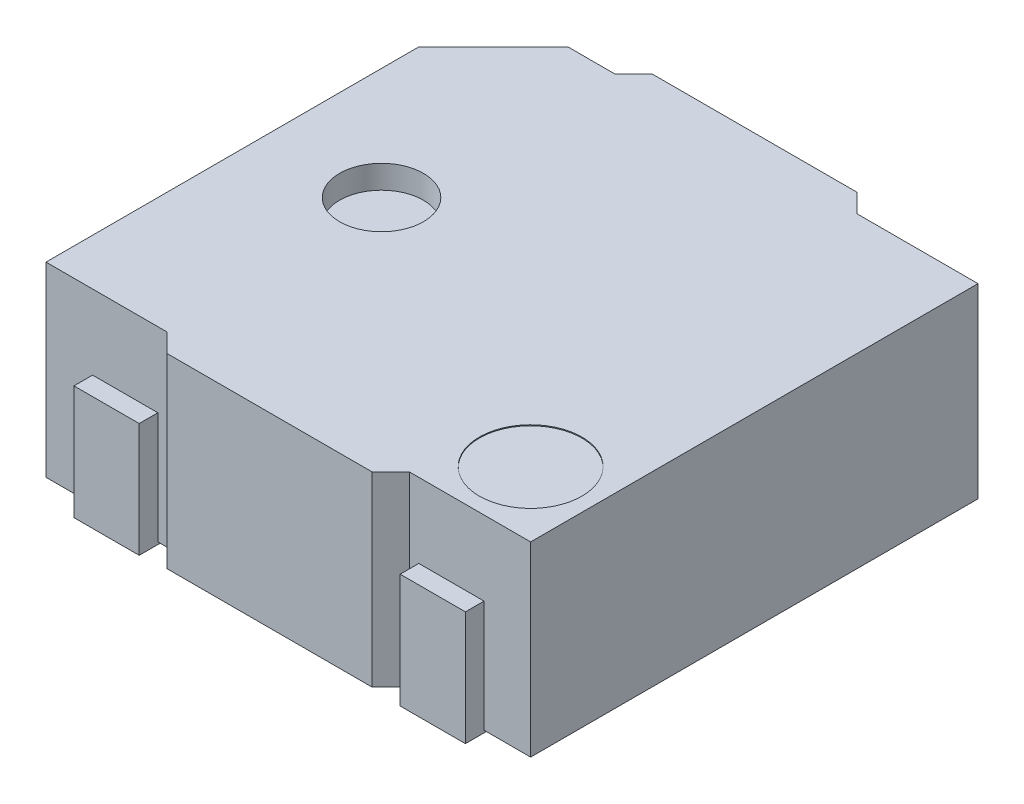
ISO-10303-21;
HEADER;
FILE_DESCRIPTION(('STEP AP214'),'2;1');
FILE_NAME('part.step','',(''),(''),'','','');
FILE_SCHEMA(('AUTOMOTIVE_DESIGN { 1 0 10303 214 1 1 1 1 }'));
ENDSEC;
DATA;
#1=APPLICATION_CONTEXT('core data for automotive mechanical design processes');
#2=APPLICATION_PROTOCOL_DEFINITION('international standard','automotive_design',2000,#1);
#3=PRODUCT_CONTEXT('',#1,'mechanical');
#4=PRODUCT('Part','Part','',(#3));
#5=PRODUCT_RELATED_PRODUCT_CATEGORY('part','',(#4));
#6=PRODUCT_DEFINITION_FORMATION('','',#4);
#7=PRODUCT_DEFINITION_CONTEXT('part definition',#1,'design');
#8=PRODUCT_DEFINITION('design','',#6,#7);
#9=PRODUCT_DEFINITION_SHAPE('','',#8);
#10=(LENGTH_UNIT() NAMED_UNIT(*) SI_UNIT(.MILLI.,.METRE.));
#11=(NAMED_UNIT(*) PLANE_ANGLE_UNIT() SI_UNIT($,.RADIAN.));
#12=(NAMED_UNIT(*) SI_UNIT($,.STERADIAN.) SOLID_ANGLE_UNIT());
#13=UNCERTAINTY_MEASURE_WITH_UNIT(LENGTH_MEASURE(1.E-05),#10,'distance_accuracy_value','');
#14=(GEOMETRIC_REPRESENTATION_CONTEXT(3) GLOBAL_UNCERTAINTY_ASSIGNED_CONTEXT((#13)) GLOBAL_UNIT_ASSIGNED_CONTEXT((#10,
#11,#12)) REPRESENTATION_CONTEXT('',''));
#15=CARTESIAN_POINT('',(0.,0.,0.));
#16=DIRECTION('',(0.,0.,1.));
#17=DIRECTION('',(1.,0.,0.));
#18=AXIS2_PLACEMENT_3D('',#15,#16,#17);
#19=CARTESIAN_POINT('',(2.6,2.025,2.60000000000001));
#20=DIRECTION('',(-1.,0.,0.));
#21=DIRECTION('',(0.,0.,1.));
#22=AXIS2_PLACEMENT_3D('',#19,#20,#21);
#23=PLANE('',#22);
#24=DIRECTION('',(0.,0.,-1.));
#25=VECTOR('',#24,1.);
#26=CARTESIAN_POINT('',(2.6,2.025,2.60000000000001));
#27=LINE('',#26,#25);
#28=CARTESIAN_POINT('',(2.6,2.025,2.40000000000001));
#29=VERTEX_POINT('',#28);
#30=CARTESIAN_POINT('',(2.6,2.025,-2.40000000000001));
#31=VERTEX_POINT('',#30);
#32=EDGE_CURVE('E520',#29,#31,#27,.T.);
#33=ORIENTED_EDGE('',*,*,#32,.F.);
#34=DIRECTION('',(0.,1.,0.));
#35=VECTOR('',#34,1.);
#36=CARTESIAN_POINT('',(2.6,0.0249999999999998,2.40000000000001));
#37=LINE('',#36,#35);
#38=CARTESIAN_POINT('',(2.6,0.0249999999999998,2.40000000000001));
#39=VERTEX_POINT('',#38);
#40=EDGE_CURVE('E412',#39,#29,#37,.T.);
#41=ORIENTED_EDGE('',*,*,#40,.F.);
#42=DIRECTION('',(0.,0.,-1.));
#43=VECTOR('',#42,1.);
#44=CARTESIAN_POINT('',(2.6,0.025,2.60000000000001));
#45=LINE('',#44,#43);
#46=CARTESIAN_POINT('',(2.6,0.0249999999999998,-2.40000000000001));
#47=VERTEX_POINT('',#46);
#48=EDGE_CURVE('E519',#39,#47,#45,.T.);
#49=ORIENTED_EDGE('',*,*,#48,.T.);
#50=DIRECTION('',(0.,1.,0.));
#51=VECTOR('',#50,1.);
#52=CARTESIAN_POINT('',(2.6,0.0249999999999998,-2.40000000000001));
#53=LINE('',#52,#51);
#54=EDGE_CURVE('E418',#47,#31,#53,.T.);
#55=ORIENTED_EDGE('',*,*,#54,.T.);
#56=EDGE_LOOP('',(#33,#41,#49,#55));
#57=FACE_BOUND('',#56,.T.);
#58=ADVANCED_FACE('F39',(#57),#23,.F.);
#59=CARTESIAN_POINT('',(-2.6,2.025,-2.60000000000002));
#60=DIRECTION('',(0.,0.,1.));
#61=DIRECTION('',(1.,0.,0.));
#62=AXIS2_PLACEMENT_3D('',#59,#60,#61);
#63=PLANE('',#62);
#64=DIRECTION('',(-1.,0.,0.));
#65=VECTOR('',#64,1.);
#66=CARTESIAN_POINT('',(-2.6,2.025,-2.60000000000002));
#67=LINE('',#66,#65);
#68=CARTESIAN_POINT('',(1.1,2.025,-2.60000000000001));
#69=VERTEX_POINT('',#68);
#70=CARTESIAN_POINT('',(-1.1,2.025,-2.60000000000001));
#71=VERTEX_POINT('',#70);
#72=EDGE_CURVE('E524',#69,#71,#67,.T.);
#73=ORIENTED_EDGE('',*,*,#72,.F.);
#74=DIRECTION('',(0.,1.,0.));
#75=VECTOR('',#74,1.);
#76=CARTESIAN_POINT('',(1.1,0.0249999999999998,-2.60000000000001));
#77=LINE('',#76,#75);
#78=CARTESIAN_POINT('',(1.1,0.0249999999999998,-2.60000000000001));
#79=VERTEX_POINT('',#78);
#80=EDGE_CURVE('E483',#79,#69,#77,.T.);
#81=ORIENTED_EDGE('',*,*,#80,.F.);
#82=DIRECTION('',(-1.,0.,0.));
#83=VECTOR('',#82,1.);
#84=CARTESIAN_POINT('',(-2.6,0.025,-2.60000000000002));
#85=LINE('',#84,#83);
#86=CARTESIAN_POINT('',(-1.1,0.0249999999999998,-2.60000000000001));
#87=VERTEX_POINT('',#86);
#88=EDGE_CURVE('E541',#79,#87,#85,.T.);
#89=ORIENTED_EDGE('',*,*,#88,.T.);
#90=DIRECTION('',(0.,1.,0.));
#91=VECTOR('',#90,1.);
#92=CARTESIAN_POINT('',(-1.1,0.0249999999999998,-2.60000000000001));
#93=LINE('',#92,#91);
#94=EDGE_CURVE('E486',#87,#71,#93,.T.);
#95=ORIENTED_EDGE('',*,*,#94,.T.);
#96=EDGE_LOOP('',(#73,#81,#89,#95));
#97=FACE_BOUND('',#96,.T.);
#98=ADVANCED_FACE('F607',(#97),#63,.F.);
#99=CARTESIAN_POINT('',(-2.6,2.025,2.60000000000001));
#100=DIRECTION('',(1.,0.,0.));
#101=DIRECTION('',(0.,0.,-1.));
#102=AXIS2_PLACEMENT_3D('',#99,#100,#101);
#103=PLANE('',#102);
#104=DIRECTION('',(0.,0.,1.));
#105=VECTOR('',#104,1.);
#106=CARTESIAN_POINT('',(-2.6,0.025,2.60000000000001));
#107=LINE('',#106,#105);
#108=CARTESIAN_POINT('',(-2.6,0.0249999999999998,-1.60000000000002));
#109=VERTEX_POINT('',#108);
#110=CARTESIAN_POINT('',(-2.6,0.0249999999999998,2.40000000000001));
#111=VERTEX_POINT('',#110);
#112=EDGE_CURVE('E545',#109,#111,#107,.T.);
#113=ORIENTED_EDGE('',*,*,#112,.T.);
#114=DIRECTION('',(0.,1.,0.));
#115=VECTOR('',#114,1.);
#116=CARTESIAN_POINT('',(-2.6,0.0249999999999998,2.40000000000001));
#117=LINE('',#116,#115);
#118=CARTESIAN_POINT('',(-2.6,2.025,2.40000000000001));
#119=VERTEX_POINT('',#118);
#120=EDGE_CURVE('E428',#111,#119,#117,.T.);
#121=ORIENTED_EDGE('',*,*,#120,.T.);
#122=DIRECTION('',(0.,0.,1.));
#123=VECTOR('',#122,1.);
#124=CARTESIAN_POINT('',(-2.6,2.025,2.60000000000001));
#125=LINE('',#124,#123);
#126=CARTESIAN_POINT('',(-2.6,2.025,-1.60000000000002));
#127=VERTEX_POINT('',#126);
#128=EDGE_CURVE('E529',#127,#119,#125,.T.);
#129=ORIENTED_EDGE('',*,*,#128,.F.);
#130=DIRECTION('',(0.,1.,0.));
#131=VECTOR('',#130,1.);
#132=CARTESIAN_POINT('',(-2.6,0.0249999999999998,-1.60000000000002));
#133=LINE('',#132,#131);
#134=EDGE_CURVE('E513',#109,#127,#133,.T.);
#135=ORIENTED_EDGE('',*,*,#134,.F.);
#136=EDGE_LOOP('',(#113,#121,#129,#135));
#137=FACE_BOUND('',#136,.T.);
#138=ADVANCED_FACE('F654',(#137),#103,.F.);
#139=CARTESIAN_POINT('',(-2.6,2.025,2.60000000000001));
#140=DIRECTION('',(0.,0.,-1.));
#141=DIRECTION('',(-1.,0.,0.));
#142=AXIS2_PLACEMENT_3D('',#139,#140,#141);
#143=PLANE('',#142);
#144=DIRECTION('',(1.,0.,0.));
#145=VECTOR('',#144,1.);
#146=CARTESIAN_POINT('',(-2.6,2.025,2.60000000000001));
#147=LINE('',#146,#145);
#148=CARTESIAN_POINT('',(-1.1,2.025,2.60000000000001));
#149=VERTEX_POINT('',#148);
#150=CARTESIAN_POINT('',(1.1,2.025,2.60000000000001));
#151=VERTEX_POINT('',#150);
#152=EDGE_CURVE('E533',#149,#151,#147,.T.);
#153=ORIENTED_EDGE('',*,*,#152,.F.);
#154=DIRECTION('',(0.,1.,0.));
#155=VECTOR('',#154,1.);
#156=CARTESIAN_POINT('',(-1.1,0.0249999999999998,2.60000000000001));
#157=LINE('',#156,#155);
#158=CARTESIAN_POINT('',(-1.1,0.0249999999999998,2.60000000000001));
#159=VERTEX_POINT('',#158);
#160=EDGE_CURVE('E436',#159,#149,#157,.T.);
#161=ORIENTED_EDGE('',*,*,#160,.F.);
#162=DIRECTION('',(1.,0.,0.));
#163=VECTOR('',#162,1.);
#164=CARTESIAN_POINT('',(-2.6,0.025,2.60000000000001));
#165=LINE('',#164,#163);
#166=CARTESIAN_POINT('',(1.1,0.0249999999999998,2.60000000000001));
#167=VERTEX_POINT('',#166);
#168=EDGE_CURVE('E525',#159,#167,#165,.T.);
#169=ORIENTED_EDGE('',*,*,#168,.T.);
#170=DIRECTION('',(0.,1.,0.));
#171=VECTOR('',#170,1.);
#172=CARTESIAN_POINT('',(1.1,0.0249999999999998,2.60000000000001));
#173=LINE('',#172,#171);
#174=EDGE_CURVE('E439',#167,#151,#173,.T.);
#175=ORIENTED_EDGE('',*,*,#174,.T.);
#176=EDGE_LOOP('',(#153,#161,#169,#175));
#177=FACE_BOUND('',#176,.T.);
#178=ADVANCED_FACE('F630',(#177),#143,.F.);
#179=CARTESIAN_POINT('',(0.,2.025,0.));
#180=DIRECTION('',(0.,-1.,0.));
#181=DIRECTION('',(0.,0.,-1.));
#182=AXIS2_PLACEMENT_3D('',#179,#180,#181);
#183=PLANE('',#182);
#184=CARTESIAN_POINT('',(1.90000000000001,2.025,1.70000000000001));
#185=DIRECTION('',(0.,1.,0.));
#186=DIRECTION('',(0.,0.,1.));
#187=AXIS2_PLACEMENT_3D('',#184,#185,#186);
#188=CIRCLE('',#187,0.550000000000001);
#189=CARTESIAN_POINT('',(1.90000000000001,2.025,2.25000000000001));
#190=VERTEX_POINT('',#189);
#191=EDGE_CURVE('E273',#190,#190,#188,.T.);
#192=ORIENTED_EDGE('',*,*,#191,.F.);
#193=EDGE_LOOP('',(#192));
#194=FACE_BOUND('',#193,.T.);
#195=CARTESIAN_POINT('',(-1.4,2.025,0.));
#196=DIRECTION('',(0.,1.,0.));
#197=DIRECTION('',(0.,0.,1.));
#198=AXIS2_PLACEMENT_3D('',#195,#196,#197);
#199=CIRCLE('',#198,0.45);
#200=CARTESIAN_POINT('',(-1.4,2.025,0.45));
#201=VERTEX_POINT('',#200);
#202=EDGE_CURVE('E504',#201,#201,#199,.T.);
#203=ORIENTED_EDGE('',*,*,#202,.F.);
#204=EDGE_LOOP('',(#203));
#205=FACE_BOUND('',#204,.T.);
#206=ORIENTED_EDGE('',*,*,#128,.T.);
#207=DIRECTION('',(-1.,0.,0.));
#208=VECTOR('',#207,1.);
#209=CARTESIAN_POINT('',(-2.6,2.025,2.40000000000001));
#210=LINE('',#209,#208);
#211=CARTESIAN_POINT('',(-1.3,2.025,2.40000000000001));
#212=VERTEX_POINT('',#211);
#213=EDGE_CURVE('E425',#212,#119,#210,.T.);
#214=ORIENTED_EDGE('',*,*,#213,.F.);
#215=DIRECTION('',(-0.707106781186546,0.,-0.707106781186549));
#216=VECTOR('',#215,1.);
#217=CARTESIAN_POINT('',(-1.3,2.025,2.40000000000001));
#218=LINE('',#217,#216);
#219=EDGE_CURVE('E421',#149,#212,#218,.T.);
#220=ORIENTED_EDGE('',*,*,#219,.F.);
#221=ORIENTED_EDGE('',*,*,#152,.T.);
#222=DIRECTION('',(-0.707106781186548,0.,0.707106781186547));
#223=VECTOR('',#222,1.);
#224=CARTESIAN_POINT('',(1.1,2.025,2.60000000000001));
#225=LINE('',#224,#223);
#226=CARTESIAN_POINT('',(1.3,2.025,2.40000000000001));
#227=VERTEX_POINT('',#226);
#228=EDGE_CURVE('E417',#227,#151,#225,.T.);
#229=ORIENTED_EDGE('',*,*,#228,.F.);
#230=DIRECTION('',(-1.,0.,0.));
#231=VECTOR('',#230,1.);
#232=CARTESIAN_POINT('',(1.3,2.025,2.40000000000001));
#233=LINE('',#232,#231);
#234=EDGE_CURVE('E413',#29,#227,#233,.T.);
#235=ORIENTED_EDGE('',*,*,#234,.F.);
#236=ORIENTED_EDGE('',*,*,#32,.T.);
#237=DIRECTION('',(1.,0.,0.));
#238=VECTOR('',#237,1.);
#239=CARTESIAN_POINT('',(1.3,2.025,-2.40000000000001));
#240=LINE('',#239,#238);
#241=CARTESIAN_POINT('',(1.3,2.025,-2.40000000000001));
#242=VERTEX_POINT('',#241);
#243=EDGE_CURVE('E452',#242,#31,#240,.T.);
#244=ORIENTED_EDGE('',*,*,#243,.F.);
#245=DIRECTION('',(0.707106781186548,0.,0.707106781186547));
#246=VECTOR('',#245,1.);
#247=CARTESIAN_POINT('',(1.1,2.025,-2.60000000000001));
#248=LINE('',#247,#246);
#249=EDGE_CURVE('E471',#69,#242,#248,.T.);
#250=ORIENTED_EDGE('',*,*,#249,.F.);
#251=ORIENTED_EDGE('',*,*,#72,.T.);
#252=DIRECTION('',(0.707106781186546,0.,-0.707106781186549));
#253=VECTOR('',#252,1.);
#254=CARTESIAN_POINT('',(-1.3,2.025,-2.40000000000001));
#255=LINE('',#254,#253);
#256=CARTESIAN_POINT('',(-1.3,2.025,-2.40000000000001));
#257=VERTEX_POINT('',#256);
#258=EDGE_CURVE('E468',#257,#71,#255,.T.);
#259=ORIENTED_EDGE('',*,*,#258,.F.);
#260=DIRECTION('',(1.,0.,0.));
#261=VECTOR('',#260,1.);
#262=CARTESIAN_POINT('',(-2.6,2.025,-2.40000000000001));
#263=LINE('',#262,#261);
#264=CARTESIAN_POINT('',(-1.80000000000001,2.025,-2.40000000000001));
#265=VERTEX_POINT('',#264);
#266=EDGE_CURVE('E393',#265,#257,#263,.T.);
#267=ORIENTED_EDGE('',*,*,#266,.F.);
#268=DIRECTION('',(0.707106781186549,0.,-0.707106781186546));
#269=VECTOR('',#268,1.);
#270=CARTESIAN_POINT('',(-2.6,2.025,-1.60000000000002));
#271=LINE('',#270,#269);
#272=EDGE_CURVE('E508',#127,#265,#271,.T.);
#273=ORIENTED_EDGE('',*,*,#272,.F.);
#274=EDGE_LOOP('',(#206,#214,#220,#221,#229,#235,#236,#244,#250,#251,#259,#267,#273));
#275=FACE_BOUND('',#274,.T.);
#276=ADVANCED_FACE('F610',(#194,#205,#275),#183,.F.);
#277=CARTESIAN_POINT('',(0.,0.025,0.));
#278=DIRECTION('',(0.,-1.,0.));
#279=DIRECTION('',(0.,0.,-1.));
#280=AXIS2_PLACEMENT_3D('',#277,#278,#279);
#281=PLANE('',#280);
#282=DIRECTION('',(0.,0.,-1.));
#283=VECTOR('',#282,1.);
#284=CARTESIAN_POINT('',(1.4,0.025,0.));
#285=LINE('',#284,#283);
#286=CARTESIAN_POINT('',(1.4,0.0250000000000001,-1.70000000000001));
#287=VERTEX_POINT('',#286);
#288=CARTESIAN_POINT('',(1.4,0.0249999999999998,-2.40000000000001));
#289=VERTEX_POINT('',#288);
#290=EDGE_CURVE('E300',#287,#289,#285,.T.);
#291=ORIENTED_EDGE('',*,*,#290,.F.);
#292=DIRECTION('',(-1.,0.,0.));
#293=VECTOR('',#292,1.);
#294=CARTESIAN_POINT('',(0.,0.025,-1.70000000000001));
#295=LINE('',#294,#293);
#296=CARTESIAN_POINT('',(2.1,0.0250000000000001,-1.70000000000001));
#297=VERTEX_POINT('',#296);
#298=EDGE_CURVE('E11',#297,#287,#295,.T.);
#299=ORIENTED_EDGE('',*,*,#298,.F.);
#300=DIRECTION('',(0.,0.,1.));
#301=VECTOR('',#300,1.);
#302=CARTESIAN_POINT('',(2.1,0.025,0.));
#303=LINE('',#302,#301);
#304=CARTESIAN_POINT('',(2.1,0.0249999999999998,-2.40000000000001));
#305=VERTEX_POINT('',#304);
#306=EDGE_CURVE('E292',#305,#297,#303,.T.);
#307=ORIENTED_EDGE('',*,*,#306,.F.);
#308=DIRECTION('',(1.,0.,0.));
#309=VECTOR('',#308,1.);
#310=CARTESIAN_POINT('',(1.3,0.0249999999999998,-2.40000000000001));
#311=LINE('',#310,#309);
#312=EDGE_CURVE('E460',#305,#47,#311,.T.);
#313=ORIENTED_EDGE('',*,*,#312,.T.);
#314=ORIENTED_EDGE('',*,*,#48,.F.);
#315=DIRECTION('',(-1.,0.,0.));
#316=VECTOR('',#315,1.);
#317=CARTESIAN_POINT('',(1.3,0.0249999999999998,2.40000000000001));
#318=LINE('',#317,#316);
#319=CARTESIAN_POINT('',(2.1,0.0249999999999998,2.40000000000001));
#320=VERTEX_POINT('',#319);
#321=EDGE_CURVE('E394',#39,#320,#318,.T.);
#322=ORIENTED_EDGE('',*,*,#321,.T.);
#323=DIRECTION('',(0.,0.,1.));
#324=VECTOR('',#323,1.);
#325=CARTESIAN_POINT('',(2.1,0.025,0.));
#326=LINE('',#325,#324);
#327=CARTESIAN_POINT('',(2.1,0.025,1.70000000000001));
#328=VERTEX_POINT('',#327);
#329=EDGE_CURVE('E377',#328,#320,#326,.T.);
#330=ORIENTED_EDGE('',*,*,#329,.F.);
#331=DIRECTION('',(1.,0.,0.));
#332=VECTOR('',#331,1.);
#333=CARTESIAN_POINT('',(0.,0.025,1.70000000000001));
#334=LINE('',#333,#332);
#335=CARTESIAN_POINT('',(1.4,0.025,1.70000000000001));
#336=VERTEX_POINT('',#335);
#337=EDGE_CURVE('E565',#336,#328,#334,.T.);
#338=ORIENTED_EDGE('',*,*,#337,.F.);
#339=DIRECTION('',(0.,0.,-1.));
#340=VECTOR('',#339,1.);
#341=CARTESIAN_POINT('',(1.4,0.025,0.));
#342=LINE('',#341,#340);
#343=CARTESIAN_POINT('',(1.4,0.0249999999999998,2.40000000000001));
#344=VERTEX_POINT('',#343);
#345=EDGE_CURVE('E389',#344,#336,#342,.T.);
#346=ORIENTED_EDGE('',*,*,#345,.F.);
#347=CARTESIAN_POINT('',(1.3,0.025,2.40000000000001));
#348=VERTEX_POINT('',#347);
#349=EDGE_CURVE('E399',#344,#348,#318,.T.);
#350=ORIENTED_EDGE('',*,*,#349,.T.);
#351=DIRECTION('',(-0.707106781186548,0.,0.707106781186547));
#352=VECTOR('',#351,1.);
#353=CARTESIAN_POINT('',(1.1,0.0249999999999998,2.60000000000001));
#354=LINE('',#353,#352);
#355=EDGE_CURVE('E398',#348,#167,#354,.T.);
#356=ORIENTED_EDGE('',*,*,#355,.T.);
#357=ORIENTED_EDGE('',*,*,#168,.F.);
#358=DIRECTION('',(-0.707106781186546,0.,-0.707106781186549));
#359=VECTOR('',#358,1.);
#360=CARTESIAN_POINT('',(-1.3,0.0249999999999998,2.40000000000001));
#361=LINE('',#360,#359);
#362=CARTESIAN_POINT('',(-1.3,0.025,2.40000000000001));
#363=VERTEX_POINT('',#362);
#364=EDGE_CURVE('E403',#159,#363,#361,.T.);
#365=ORIENTED_EDGE('',*,*,#364,.T.);
#366=DIRECTION('',(-1.,0.,0.));
#367=VECTOR('',#366,1.);
#368=CARTESIAN_POINT('',(-2.6,0.0249999999999998,2.40000000000001));
#369=LINE('',#368,#367);
#370=CARTESIAN_POINT('',(-1.4,0.0249999999999998,2.40000000000001));
#371=VERTEX_POINT('',#370);
#372=EDGE_CURVE('E408',#363,#371,#369,.T.);
#373=ORIENTED_EDGE('',*,*,#372,.T.);
#374=DIRECTION('',(0.,0.,1.));
#375=VECTOR('',#374,1.);
#376=CARTESIAN_POINT('',(-1.4,0.025,0.));
#377=LINE('',#376,#375);
#378=CARTESIAN_POINT('',(-1.4,0.0250000000000001,1.70000000000001));
#379=VERTEX_POINT('',#378);
#380=EDGE_CURVE('E343',#379,#371,#377,.T.);
#381=ORIENTED_EDGE('',*,*,#380,.F.);
#382=DIRECTION('',(1.,0.,0.));
#383=VECTOR('',#382,1.);
#384=CARTESIAN_POINT('',(0.,0.025,1.70000000000001));
#385=LINE('',#384,#383);
#386=CARTESIAN_POINT('',(-2.1,0.0250000000000001,1.70000000000001));
#387=VERTEX_POINT('',#386);
#388=EDGE_CURVE('E581',#387,#379,#385,.T.);
#389=ORIENTED_EDGE('',*,*,#388,.F.);
#390=DIRECTION('',(0.,0.,-1.));
#391=VECTOR('',#390,1.);
#392=CARTESIAN_POINT('',(-2.1,0.025,0.));
#393=LINE('',#392,#391);
#394=CARTESIAN_POINT('',(-2.1,0.0249999999999998,2.40000000000001));
#395=VERTEX_POINT('',#394);
#396=EDGE_CURVE('E333',#395,#387,#393,.T.);
#397=ORIENTED_EDGE('',*,*,#396,.F.);
#398=EDGE_CURVE('E407',#395,#111,#369,.T.);
#399=ORIENTED_EDGE('',*,*,#398,.T.);
#400=ORIENTED_EDGE('',*,*,#112,.F.);
#401=DIRECTION('',(0.707106781186549,0.,-0.707106781186546));
#402=VECTOR('',#401,1.);
#403=CARTESIAN_POINT('',(-2.6,0.0249999999999998,-1.60000000000002));
#404=LINE('',#403,#402);
#405=CARTESIAN_POINT('',(-1.80000000000001,0.0249999999999998,-2.40000000000001));
#406=VERTEX_POINT('',#405);
#407=EDGE_CURVE('E509',#109,#406,#404,.T.);
#408=ORIENTED_EDGE('',*,*,#407,.T.);
#409=DIRECTION('',(1.,0.,0.));
#410=VECTOR('',#409,1.);
#411=CARTESIAN_POINT('',(-2.6,0.0249999999999998,-2.40000000000001));
#412=LINE('',#411,#410);
#413=CARTESIAN_POINT('',(-1.3,0.0249999999999998,-2.40000000000001));
#414=VERTEX_POINT('',#413);
#415=EDGE_CURVE('E447',#406,#414,#412,.T.);
#416=ORIENTED_EDGE('',*,*,#415,.T.);
#417=DIRECTION('',(0.707106781186546,0.,-0.707106781186549));
#418=VECTOR('',#417,1.);
#419=CARTESIAN_POINT('',(-1.3,0.0249999999999998,-2.40000000000001));
#420=LINE('',#419,#418);
#421=EDGE_CURVE('E451',#414,#87,#420,.T.);
#422=ORIENTED_EDGE('',*,*,#421,.T.);
#423=ORIENTED_EDGE('',*,*,#88,.F.);
#424=DIRECTION('',(0.707106781186548,0.,0.707106781186547));
#425=VECTOR('',#424,1.);
#426=CARTESIAN_POINT('',(1.1,0.0249999999999998,-2.60000000000001));
#427=LINE('',#426,#425);
#428=CARTESIAN_POINT('',(1.3,0.025,-2.40000000000001));
#429=VERTEX_POINT('',#428);
#430=EDGE_CURVE('E456',#79,#429,#427,.T.);
#431=ORIENTED_EDGE('',*,*,#430,.T.);
#432=EDGE_CURVE('E461',#429,#289,#311,.T.);
#433=ORIENTED_EDGE('',*,*,#432,.T.);
#434=EDGE_LOOP('',(#291,#299,#307,#313,#314,#322,#330,#338,#346,#350,#356,#357,#365,#373,#381,
#389,#397,#399,#400,#408,#416,#422,#423,#431,#433));
#435=FACE_BOUND('',#434,.T.);
#436=ADVANCED_FACE('F598',(#435),#281,.T.);
#437=CARTESIAN_POINT('',(-2.6,0.0249999999999998,-1.60000000000002));
#438=DIRECTION('',(0.707106781186546,0.,0.707106781186549));
#439=DIRECTION('',(0.707106781186549,0.,-0.707106781186546));
#440=AXIS2_PLACEMENT_3D('',#437,#438,#439);
#441=PLANE('',#440);
#442=ORIENTED_EDGE('',*,*,#272,.T.);
#443=DIRECTION('',(0.,-1.,0.));
#444=VECTOR('',#443,1.);
#445=CARTESIAN_POINT('',(-1.80000000000001,0.0249999999999998,-2.40000000000001));
#446=LINE('',#445,#444);
#447=EDGE_CURVE('E537',#265,#406,#446,.T.);
#448=ORIENTED_EDGE('',*,*,#447,.T.);
#449=ORIENTED_EDGE('',*,*,#407,.F.);
#450=ORIENTED_EDGE('',*,*,#134,.T.);
#451=EDGE_LOOP('',(#442,#448,#449,#450));
#452=FACE_BOUND('',#451,.T.);
#453=ADVANCED_FACE('F637',(#452),#441,.F.);
#454=CARTESIAN_POINT('',(-1.4,1.775,0.));
#455=DIRECTION('',(0.,1.,0.));
#456=DIRECTION('',(0.,0.,1.));
#457=AXIS2_PLACEMENT_3D('',#454,#455,#456);
#458=CYLINDRICAL_SURFACE('',#457,0.45);
#459=CARTESIAN_POINT('',(-1.4,1.775,0.));
#460=DIRECTION('',(0.,1.,0.));
#461=DIRECTION('',(0.,0.,1.));
#462=AXIS2_PLACEMENT_3D('',#459,#460,#461);
#463=CIRCLE('',#462,0.45);
#464=CARTESIAN_POINT('',(-1.4,1.775,0.45));
#465=VERTEX_POINT('',#464);
#466=EDGE_CURVE('E497',#465,#465,#463,.T.);
#467=ORIENTED_EDGE('',*,*,#466,.F.);
#468=EDGE_LOOP('',(#467));
#469=FACE_BOUND('',#468,.T.);
#470=ORIENTED_EDGE('',*,*,#202,.T.);
#471=EDGE_LOOP('',(#470));
#472=FACE_BOUND('',#471,.T.);
#473=ADVANCED_FACE('F634',(#469,#472),#458,.F.);
#474=CARTESIAN_POINT('',(-1.4,1.575,0.));
#475=DIRECTION('',(0.,1.,0.));
#476=DIRECTION('',(0.,0.,1.));
#477=AXIS2_PLACEMENT_3D('',#474,#475,#476);
#478=CYLINDRICAL_SURFACE('',#477,0.8);
#479=CARTESIAN_POINT('',(-1.4,1.575,0.));
#480=DIRECTION('',(0.,1.,0.));
#481=DIRECTION('',(0.,0.,1.));
#482=AXIS2_PLACEMENT_3D('',#479,#480,#481);
#483=CIRCLE('',#482,0.8);
#484=CARTESIAN_POINT('',(-1.4,1.575,0.8));
#485=VERTEX_POINT('',#484);
#486=EDGE_CURVE('E493',#485,#485,#483,.T.);
#487=ORIENTED_EDGE('',*,*,#486,.F.);
#488=EDGE_LOOP('',(#487));
#489=FACE_BOUND('',#488,.T.);
#490=CARTESIAN_POINT('',(-1.4,1.775,0.));
#491=DIRECTION('',(0.,1.,0.));
#492=DIRECTION('',(0.,0.,1.));
#493=AXIS2_PLACEMENT_3D('',#490,#491,#492);
#494=CIRCLE('',#493,0.8);
#495=CARTESIAN_POINT('',(-1.4,1.775,0.8));
#496=VERTEX_POINT('',#495);
#497=EDGE_CURVE('E432',#496,#496,#494,.T.);
#498=ORIENTED_EDGE('',*,*,#497,.T.);
#499=EDGE_LOOP('',(#498));
#500=FACE_BOUND('',#499,.T.);
#501=ADVANCED_FACE('F636',(#489,#500),#478,.F.);
#502=CARTESIAN_POINT('',(-1.4,1.575,0.));
#503=DIRECTION('',(0.,1.,0.));
#504=DIRECTION('',(0.,0.,1.));
#505=AXIS2_PLACEMENT_3D('',#502,#503,#504);
#506=PLANE('',#505);
#507=ORIENTED_EDGE('',*,*,#486,.T.);
#508=EDGE_LOOP('',(#507));
#509=FACE_BOUND('',#508,.T.);
#510=ADVANCED_FACE('F644',(#509),#506,.T.);
#511=CARTESIAN_POINT('',(-1.4,1.775,0.));
#512=DIRECTION('',(0.,1.,0.));
#513=DIRECTION('',(0.,0.,1.));
#514=AXIS2_PLACEMENT_3D('',#511,#512,#513);
#515=PLANE('',#514);
#516=ORIENTED_EDGE('',*,*,#466,.T.);
#517=EDGE_LOOP('',(#516));
#518=FACE_BOUND('',#517,.T.);
#519=ORIENTED_EDGE('',*,*,#497,.F.);
#520=EDGE_LOOP('',(#519));
#521=FACE_BOUND('',#520,.T.);
#522=ADVANCED_FACE('F690',(#518,#521),#515,.F.);
#523=CARTESIAN_POINT('',(-2.6,0.0249999999999998,-2.40000000000001));
#524=DIRECTION('',(0.,0.,1.));
#525=DIRECTION('',(1.,0.,0.));
#526=AXIS2_PLACEMENT_3D('',#523,#524,#525);
#527=PLANE('',#526);
#528=ORIENTED_EDGE('',*,*,#266,.T.);
#529=DIRECTION('',(0.,1.,0.));
#530=VECTOR('',#529,1.);
#531=CARTESIAN_POINT('',(-1.3,0.0249999999999998,-2.40000000000001));
#532=LINE('',#531,#530);
#533=EDGE_CURVE('E465',#414,#257,#532,.T.);
#534=ORIENTED_EDGE('',*,*,#533,.F.);
#535=ORIENTED_EDGE('',*,*,#415,.F.);
#536=ORIENTED_EDGE('',*,*,#447,.F.);
#537=EDGE_LOOP('',(#528,#534,#535,#536));
#538=FACE_BOUND('',#537,.T.);
#539=ADVANCED_FACE('F699',(#538),#527,.F.);
#540=CARTESIAN_POINT('',(-1.3,0.0249999999999998,-2.40000000000001));
#541=DIRECTION('',(0.707106781186549,0.,0.707106781186546));
#542=DIRECTION('',(0.707106781186546,0.,-0.707106781186549));
#543=AXIS2_PLACEMENT_3D('',#540,#541,#542);
#544=PLANE('',#543);
#545=ORIENTED_EDGE('',*,*,#258,.T.);
#546=ORIENTED_EDGE('',*,*,#94,.F.);
#547=ORIENTED_EDGE('',*,*,#421,.F.);
#548=ORIENTED_EDGE('',*,*,#533,.T.);
#549=EDGE_LOOP('',(#545,#546,#547,#548));
#550=FACE_BOUND('',#549,.T.);
#551=ADVANCED_FACE('F708',(#550),#544,.F.);
#552=CARTESIAN_POINT('',(1.3,0.0249999999999998,-2.40000000000001));
#553=DIRECTION('',(0.,0.,1.));
#554=DIRECTION('',(1.,0.,0.));
#555=AXIS2_PLACEMENT_3D('',#552,#553,#554);
#556=PLANE('',#555);
#557=DIRECTION('',(-1.,0.,0.));
#558=VECTOR('',#557,1.);
#559=CARTESIAN_POINT('',(1.3,1.225,-2.40000000000001));
#560=LINE('',#559,#558);
#561=CARTESIAN_POINT('',(2.1,1.225,-2.40000000000001));
#562=VERTEX_POINT('',#561);
#563=CARTESIAN_POINT('',(1.4,1.225,-2.40000000000001));
#564=VERTEX_POINT('',#563);
#565=EDGE_CURVE('E584',#562,#564,#560,.T.);
#566=ORIENTED_EDGE('',*,*,#565,.T.);
#567=DIRECTION('',(0.,-1.,0.));
#568=VECTOR('',#567,1.);
#569=CARTESIAN_POINT('',(1.4,0.0249999999999998,-2.40000000000001));
#570=LINE('',#569,#568);
#571=EDGE_CURVE('E47',#564,#289,#570,.T.);
#572=ORIENTED_EDGE('',*,*,#571,.T.);
#573=ORIENTED_EDGE('',*,*,#432,.F.);
#574=DIRECTION('',(0.,1.,0.));
#575=VECTOR('',#574,1.);
#576=CARTESIAN_POINT('',(1.3,0.0249999999999998,-2.40000000000001));
#577=LINE('',#576,#575);
#578=EDGE_CURVE('E480',#429,#242,#577,.T.);
#579=ORIENTED_EDGE('',*,*,#578,.T.);
#580=ORIENTED_EDGE('',*,*,#243,.T.);
#581=ORIENTED_EDGE('',*,*,#54,.F.);
#582=ORIENTED_EDGE('',*,*,#312,.F.);
#583=DIRECTION('',(0.,1.,0.));
#584=VECTOR('',#583,1.);
#585=CARTESIAN_POINT('',(2.1,0.0249999999999998,-2.40000000000001));
#586=LINE('',#585,#584);
#587=EDGE_CURVE('E588',#305,#562,#586,.T.);
#588=ORIENTED_EDGE('',*,*,#587,.T.);
#589=EDGE_LOOP('',(#566,#572,#573,#579,#580,#581,#582,#588));
#590=FACE_BOUND('',#589,.T.);
#591=ADVANCED_FACE('F594',(#590),#556,.F.);
#592=CARTESIAN_POINT('',(1.1,0.0249999999999998,-2.60000000000001));
#593=DIRECTION('',(-0.707106781186547,0.,0.707106781186548));
#594=DIRECTION('',(0.707106781186548,0.,0.707106781186547));
#595=AXIS2_PLACEMENT_3D('',#592,#593,#594);
#596=PLANE('',#595);
#597=ORIENTED_EDGE('',*,*,#249,.T.);
#598=ORIENTED_EDGE('',*,*,#578,.F.);
#599=ORIENTED_EDGE('',*,*,#430,.F.);
#600=ORIENTED_EDGE('',*,*,#80,.T.);
#601=EDGE_LOOP('',(#597,#598,#599,#600));
#602=FACE_BOUND('',#601,.T.);
#603=ADVANCED_FACE('F603',(#602),#596,.F.);
#604=CARTESIAN_POINT('',(1.3,0.0249999999999998,2.40000000000001));
#605=DIRECTION('',(0.,0.,-1.));
#606=DIRECTION('',(-1.,0.,0.));
#607=AXIS2_PLACEMENT_3D('',#604,#605,#606);
#608=PLANE('',#607);
#609=ORIENTED_EDGE('',*,*,#349,.F.);
#610=DIRECTION('',(0.,1.,0.));
#611=VECTOR('',#610,1.);
#612=CARTESIAN_POINT('',(1.4,0.0249999999999998,2.40000000000001));
#613=LINE('',#612,#611);
#614=CARTESIAN_POINT('',(1.4,1.225,2.40000000000001));
#615=VERTEX_POINT('',#614);
#616=EDGE_CURVE('E562',#344,#615,#613,.T.);
#617=ORIENTED_EDGE('',*,*,#616,.T.);
#618=DIRECTION('',(-1.,0.,0.));
#619=VECTOR('',#618,1.);
#620=CARTESIAN_POINT('',(1.3,1.225,2.40000000000001));
#621=LINE('',#620,#619);
#622=CARTESIAN_POINT('',(2.1,1.225,2.40000000000001));
#623=VERTEX_POINT('',#622);
#624=EDGE_CURVE('E555',#623,#615,#621,.T.);
#625=ORIENTED_EDGE('',*,*,#624,.F.);
#626=DIRECTION('',(0.,-1.,0.));
#627=VECTOR('',#626,1.);
#628=CARTESIAN_POINT('',(2.1,0.0249999999999998,2.40000000000001));
#629=LINE('',#628,#627);
#630=EDGE_CURVE('E559',#623,#320,#629,.T.);
#631=ORIENTED_EDGE('',*,*,#630,.T.);
#632=ORIENTED_EDGE('',*,*,#321,.F.);
#633=ORIENTED_EDGE('',*,*,#40,.T.);
#634=ORIENTED_EDGE('',*,*,#234,.T.);
#635=DIRECTION('',(0.,1.,0.));
#636=VECTOR('',#635,1.);
#637=CARTESIAN_POINT('',(1.3,0.0249999999999998,2.40000000000001));
#638=LINE('',#637,#636);
#639=EDGE_CURVE('E443',#348,#227,#638,.T.);
#640=ORIENTED_EDGE('',*,*,#639,.F.);
#641=EDGE_LOOP('',(#609,#617,#625,#631,#632,#633,#634,#640));
#642=FACE_BOUND('',#641,.T.);
#643=ADVANCED_FACE('F733',(#642),#608,.F.);
#644=CARTESIAN_POINT('',(1.1,0.0249999999999998,2.60000000000001));
#645=DIRECTION('',(-0.707106781186547,0.,-0.707106781186548));
#646=DIRECTION('',(-0.707106781186548,0.,0.707106781186547));
#647=AXIS2_PLACEMENT_3D('',#644,#645,#646);
#648=PLANE('',#647);
#649=ORIENTED_EDGE('',*,*,#228,.T.);
#650=ORIENTED_EDGE('',*,*,#174,.F.);
#651=ORIENTED_EDGE('',*,*,#355,.F.);
#652=ORIENTED_EDGE('',*,*,#639,.T.);
#653=EDGE_LOOP('',(#649,#650,#651,#652));
#654=FACE_BOUND('',#653,.T.);
#655=ADVANCED_FACE('F741',(#654),#648,.F.);
#656=CARTESIAN_POINT('',(-2.6,0.0249999999999998,2.40000000000001));
#657=DIRECTION('',(0.,0.,-1.));
#658=DIRECTION('',(-1.,0.,0.));
#659=AXIS2_PLACEMENT_3D('',#656,#657,#658);
#660=PLANE('',#659);
#661=DIRECTION('',(1.,0.,0.));
#662=VECTOR('',#661,1.);
#663=CARTESIAN_POINT('',(-2.6,1.225,2.40000000000001));
#664=LINE('',#663,#662);
#665=CARTESIAN_POINT('',(-2.1,1.225,2.40000000000001));
#666=VERTEX_POINT('',#665);
#667=CARTESIAN_POINT('',(-1.4,1.225,2.40000000000001));
#668=VERTEX_POINT('',#667);
#669=EDGE_CURVE('E569',#666,#668,#664,.T.);
#670=ORIENTED_EDGE('',*,*,#669,.T.);
#671=DIRECTION('',(0.,-1.,0.));
#672=VECTOR('',#671,1.);
#673=CARTESIAN_POINT('',(-1.4,0.0249999999999998,2.40000000000001));
#674=LINE('',#673,#672);
#675=EDGE_CURVE('E577',#668,#371,#674,.T.);
#676=ORIENTED_EDGE('',*,*,#675,.T.);
#677=ORIENTED_EDGE('',*,*,#372,.F.);
#678=DIRECTION('',(0.,1.,0.));
#679=VECTOR('',#678,1.);
#680=CARTESIAN_POINT('',(-1.3,0.0249999999999998,2.40000000000001));
#681=LINE('',#680,#679);
#682=EDGE_CURVE('E433',#363,#212,#681,.T.);
#683=ORIENTED_EDGE('',*,*,#682,.T.);
#684=ORIENTED_EDGE('',*,*,#213,.T.);
#685=ORIENTED_EDGE('',*,*,#120,.F.);
#686=ORIENTED_EDGE('',*,*,#398,.F.);
#687=DIRECTION('',(0.,1.,0.));
#688=VECTOR('',#687,1.);
#689=CARTESIAN_POINT('',(-2.1,0.0249999999999998,2.40000000000001));
#690=LINE('',#689,#688);
#691=EDGE_CURVE('E573',#395,#666,#690,.T.);
#692=ORIENTED_EDGE('',*,*,#691,.T.);
#693=EDGE_LOOP('',(#670,#676,#677,#683,#684,#685,#686,#692));
#694=FACE_BOUND('',#693,.T.);
#695=ADVANCED_FACE('F750',(#694),#660,.F.);
#696=CARTESIAN_POINT('',(-1.3,0.0249999999999998,2.40000000000001));
#697=DIRECTION('',(0.707106781186549,0.,-0.707106781186546));
#698=DIRECTION('',(-0.707106781186546,0.,-0.707106781186549));
#699=AXIS2_PLACEMENT_3D('',#696,#697,#698);
#700=PLANE('',#699);
#701=ORIENTED_EDGE('',*,*,#219,.T.);
#702=ORIENTED_EDGE('',*,*,#682,.F.);
#703=ORIENTED_EDGE('',*,*,#364,.F.);
#704=ORIENTED_EDGE('',*,*,#160,.T.);
#705=EDGE_LOOP('',(#701,#702,#703,#704));
#706=FACE_BOUND('',#705,.T.);
#707=ADVANCED_FACE('F759',(#706),#700,.F.);
#708=CARTESIAN_POINT('',(0.,1.225,0.));
#709=DIRECTION('',(0.,-1.,0.));
#710=DIRECTION('',(0.,0.,-1.));
#711=AXIS2_PLACEMENT_3D('',#708,#709,#710);
#712=PLANE('',#711);
#713=DIRECTION('',(0.,0.,1.));
#714=VECTOR('',#713,1.);
#715=CARTESIAN_POINT('',(2.1,1.225,2.60000000000001));
#716=LINE('',#715,#714);
#717=CARTESIAN_POINT('',(2.1,1.225,2.60000000000001));
#718=VERTEX_POINT('',#717);
#719=EDGE_CURVE('E366',#623,#718,#716,.T.);
#720=ORIENTED_EDGE('',*,*,#719,.F.);
#721=ORIENTED_EDGE('',*,*,#624,.T.);
#722=DIRECTION('',(0.,0.,-1.));
#723=VECTOR('',#722,1.);
#724=CARTESIAN_POINT('',(1.4,1.225,2.60000000000001));
#725=LINE('',#724,#723);
#726=CARTESIAN_POINT('',(1.4,1.225,2.60000000000001));
#727=VERTEX_POINT('',#726);
#728=EDGE_CURVE('E362',#727,#615,#725,.T.);
#729=ORIENTED_EDGE('',*,*,#728,.F.);
#730=DIRECTION('',(-1.,0.,0.));
#731=VECTOR('',#730,1.);
#732=CARTESIAN_POINT('',(1.4,1.225,2.60000000000001));
#733=LINE('',#732,#731);
#734=EDGE_CURVE('E369',#718,#727,#733,.T.);
#735=ORIENTED_EDGE('',*,*,#734,.F.);
#736=EDGE_LOOP('',(#720,#721,#729,#735));
#737=FACE_BOUND('',#736,.T.);
#738=ADVANCED_FACE('F768',(#737),#712,.F.);
#739=CARTESIAN_POINT('',(1.4,1.225,2.60000000000001));
#740=DIRECTION('',(-1.,0.,0.));
#741=DIRECTION('',(0.,0.,1.));
#742=AXIS2_PLACEMENT_3D('',#739,#740,#741);
#743=PLANE('',#742);
#744=ORIENTED_EDGE('',*,*,#616,.F.);
#745=ORIENTED_EDGE('',*,*,#345,.T.);
#746=DIRECTION('',(0.,-1.,0.));
#747=VECTOR('',#746,1.);
#748=CARTESIAN_POINT('',(1.4,1.225,1.70000000000001));
#749=LINE('',#748,#747);
#750=CARTESIAN_POINT('',(1.4,0.,1.70000000000001));
#751=VERTEX_POINT('',#750);
#752=EDGE_CURVE('E373',#336,#751,#749,.T.);
#753=ORIENTED_EDGE('',*,*,#752,.T.);
#754=DIRECTION('',(0.,0.,-1.));
#755=VECTOR('',#754,1.);
#756=CARTESIAN_POINT('',(1.4,0.,2.60000000000001));
#757=LINE('',#756,#755);
#758=CARTESIAN_POINT('',(1.4,0.,2.60000000000001));
#759=VERTEX_POINT('',#758);
#760=EDGE_CURVE('E346',#759,#751,#757,.T.);
#761=ORIENTED_EDGE('',*,*,#760,.F.);
#762=DIRECTION('',(0.,-1.,0.));
#763=VECTOR('',#762,1.);
#764=CARTESIAN_POINT('',(1.4,1.225,2.60000000000001));
#765=LINE('',#764,#763);
#766=EDGE_CURVE('E374',#727,#759,#765,.T.);
#767=ORIENTED_EDGE('',*,*,#766,.F.);
#768=ORIENTED_EDGE('',*,*,#728,.T.);
#769=EDGE_LOOP('',(#744,#745,#753,#761,#767,#768));
#770=FACE_BOUND('',#769,.T.);
#771=ADVANCED_FACE('F776',(#770),#743,.T.);
#772=CARTESIAN_POINT('',(1.4,1.225,2.60000000000001));
#773=DIRECTION('',(0.,0.,1.));
#774=DIRECTION('',(1.,0.,0.));
#775=AXIS2_PLACEMENT_3D('',#772,#773,#774);
#776=PLANE('',#775);
#777=ORIENTED_EDGE('',*,*,#766,.T.);
#778=DIRECTION('',(-1.,0.,0.));
#779=VECTOR('',#778,1.);
#780=CARTESIAN_POINT('',(1.4,0.,2.60000000000001));
#781=LINE('',#780,#779);
#782=CARTESIAN_POINT('',(2.1,0.,2.60000000000001));
#783=VERTEX_POINT('',#782);
#784=EDGE_CURVE('E358',#783,#759,#781,.T.);
#785=ORIENTED_EDGE('',*,*,#784,.F.);
#786=DIRECTION('',(0.,-1.,0.));
#787=VECTOR('',#786,1.);
#788=CARTESIAN_POINT('',(2.1,1.225,2.60000000000001));
#789=LINE('',#788,#787);
#790=EDGE_CURVE('E378',#718,#783,#789,.T.);
#791=ORIENTED_EDGE('',*,*,#790,.F.);
#792=ORIENTED_EDGE('',*,*,#734,.T.);
#793=EDGE_LOOP('',(#777,#785,#791,#792));
#794=FACE_BOUND('',#793,.T.);
#795=ADVANCED_FACE('F785',(#794),#776,.T.);
#796=CARTESIAN_POINT('',(2.1,1.225,2.60000000000001));
#797=DIRECTION('',(1.,0.,0.));
#798=DIRECTION('',(0.,0.,-1.));
#799=AXIS2_PLACEMENT_3D('',#796,#797,#798);
#800=PLANE('',#799);
#801=DIRECTION('',(0.,-1.,0.));
#802=VECTOR('',#801,1.);
#803=CARTESIAN_POINT('',(2.1,1.225,1.70000000000001));
#804=LINE('',#803,#802);
#805=CARTESIAN_POINT('',(2.1,0.,1.70000000000001));
#806=VERTEX_POINT('',#805);
#807=EDGE_CURVE('E381',#328,#806,#804,.T.);
#808=ORIENTED_EDGE('',*,*,#807,.F.);
#809=ORIENTED_EDGE('',*,*,#329,.T.);
#810=ORIENTED_EDGE('',*,*,#630,.F.);
#811=ORIENTED_EDGE('',*,*,#719,.T.);
#812=ORIENTED_EDGE('',*,*,#790,.T.);
#813=DIRECTION('',(0.,0.,1.));
#814=VECTOR('',#813,1.);
#815=CARTESIAN_POINT('',(2.1,0.,2.60000000000001));
#816=LINE('',#815,#814);
#817=EDGE_CURVE('E354',#806,#783,#816,.T.);
#818=ORIENTED_EDGE('',*,*,#817,.F.);
#819=EDGE_LOOP('',(#808,#809,#810,#811,#812,#818));
#820=FACE_BOUND('',#819,.T.);
#821=ADVANCED_FACE('F794',(#820),#800,.T.);
#822=CARTESIAN_POINT('',(1.4,1.225,1.70000000000001));
#823=DIRECTION('',(0.,0.,-1.));
#824=DIRECTION('',(-1.,0.,0.));
#825=AXIS2_PLACEMENT_3D('',#822,#823,#824);
#826=PLANE('',#825);
#827=ORIENTED_EDGE('',*,*,#752,.F.);
#828=ORIENTED_EDGE('',*,*,#337,.T.);
#829=ORIENTED_EDGE('',*,*,#807,.T.);
#830=DIRECTION('',(1.,0.,0.));
#831=VECTOR('',#830,1.);
#832=CARTESIAN_POINT('',(1.4,0.,1.70000000000001));
#833=LINE('',#832,#831);
#834=EDGE_CURVE('E350',#751,#806,#833,.T.);
#835=ORIENTED_EDGE('',*,*,#834,.F.);
#836=EDGE_LOOP('',(#827,#828,#829,#835));
#837=FACE_BOUND('',#836,.T.);
#838=ADVANCED_FACE('F803',(#837),#826,.T.);
#839=CARTESIAN_POINT('',(0.,0.,0.));
#840=DIRECTION('',(0.,-1.,0.));
#841=DIRECTION('',(0.,0.,-1.));
#842=AXIS2_PLACEMENT_3D('',#839,#840,#841);
#843=PLANE('',#842);
#844=ORIENTED_EDGE('',*,*,#760,.T.);
#845=ORIENTED_EDGE('',*,*,#834,.T.);
#846=ORIENTED_EDGE('',*,*,#817,.T.);
#847=ORIENTED_EDGE('',*,*,#784,.T.);
#848=EDGE_LOOP('',(#844,#845,#846,#847));
#849=FACE_BOUND('',#848,.T.);
#850=ADVANCED_FACE('F812',(#849),#843,.T.);
#851=CARTESIAN_POINT('',(0.,1.225,0.));
#852=DIRECTION('',(0.,1.,0.));
#853=DIRECTION('',(0.,0.,1.));
#854=AXIS2_PLACEMENT_3D('',#851,#852,#853);
#855=PLANE('',#854);
#856=ORIENTED_EDGE('',*,*,#669,.F.);
#857=DIRECTION('',(0.,0.,-1.));
#858=VECTOR('',#857,1.);
#859=CARTESIAN_POINT('',(-2.1,1.225,2.60000000000001));
#860=LINE('',#859,#858);
#861=CARTESIAN_POINT('',(-2.1,1.225,2.60000000000001));
#862=VERTEX_POINT('',#861);
#863=EDGE_CURVE('E325',#862,#666,#860,.T.);
#864=ORIENTED_EDGE('',*,*,#863,.F.);
#865=DIRECTION('',(-1.,0.,0.));
#866=VECTOR('',#865,1.);
#867=CARTESIAN_POINT('',(-1.4,1.225,2.60000000000001));
#868=LINE('',#867,#866);
#869=CARTESIAN_POINT('',(-1.4,1.225,2.60000000000001));
#870=VERTEX_POINT('',#869);
#871=EDGE_CURVE('E321',#870,#862,#868,.T.);
#872=ORIENTED_EDGE('',*,*,#871,.F.);
#873=DIRECTION('',(0.,0.,1.));
#874=VECTOR('',#873,1.);
#875=CARTESIAN_POINT('',(-1.4,1.225,2.60000000000001));
#876=LINE('',#875,#874);
#877=EDGE_CURVE('E62',#668,#870,#876,.T.);
#878=ORIENTED_EDGE('',*,*,#877,.F.);
#879=EDGE_LOOP('',(#856,#864,#872,#878));
#880=FACE_BOUND('',#879,.T.);
#881=ADVANCED_FACE('F821',(#880),#855,.T.);
#882=CARTESIAN_POINT('',(-1.4,1.225,2.60000000000001));
#883=DIRECTION('',(1.,0.,0.));
#884=DIRECTION('',(0.,0.,-1.));
#885=AXIS2_PLACEMENT_3D('',#882,#883,#884);
#886=PLANE('',#885);
#887=DIRECTION('',(0.,-1.,0.));
#888=VECTOR('',#887,1.);
#889=CARTESIAN_POINT('',(-1.4,1.225,1.70000000000001));
#890=LINE('',#889,#888);
#891=CARTESIAN_POINT('',(-1.4,0.,1.70000000000001));
#892=VERTEX_POINT('',#891);
#893=EDGE_CURVE('E330',#379,#892,#890,.T.);
#894=ORIENTED_EDGE('',*,*,#893,.F.);
#895=ORIENTED_EDGE('',*,*,#380,.T.);
#896=ORIENTED_EDGE('',*,*,#675,.F.);
#897=ORIENTED_EDGE('',*,*,#877,.T.);
#898=DIRECTION('',(0.,-1.,0.));
#899=VECTOR('',#898,1.);
#900=CARTESIAN_POINT('',(-1.4,1.225,2.60000000000001));
#901=LINE('',#900,#899);
#902=CARTESIAN_POINT('',(-1.4,0.,2.60000000000001));
#903=VERTEX_POINT('',#902);
#904=EDGE_CURVE('E329',#870,#903,#901,.T.);
#905=ORIENTED_EDGE('',*,*,#904,.T.);
#906=DIRECTION('',(0.,0.,1.));
#907=VECTOR('',#906,1.);
#908=CARTESIAN_POINT('',(-1.4,0.,2.60000000000001));
#909=LINE('',#908,#907);
#910=EDGE_CURVE('E303',#892,#903,#909,.T.);
#911=ORIENTED_EDGE('',*,*,#910,.F.);
#912=EDGE_LOOP('',(#894,#895,#896,#897,#905,#911));
#913=FACE_BOUND('',#912,.T.);
#914=ADVANCED_FACE('F830',(#913),#886,.T.);
#915=CARTESIAN_POINT('',(-1.4,1.225,1.70000000000001));
#916=DIRECTION('',(0.,0.,-1.));
#917=DIRECTION('',(-1.,0.,0.));
#918=AXIS2_PLACEMENT_3D('',#915,#916,#917);
#919=PLANE('',#918);
#920=DIRECTION('',(0.,-1.,0.));
#921=VECTOR('',#920,1.);
#922=CARTESIAN_POINT('',(-2.1,1.225,1.70000000000001));
#923=LINE('',#922,#921);
#924=CARTESIAN_POINT('',(-2.1,0.,1.70000000000001));
#925=VERTEX_POINT('',#924);
#926=EDGE_CURVE('E334',#387,#925,#923,.T.);
#927=ORIENTED_EDGE('',*,*,#926,.F.);
#928=ORIENTED_EDGE('',*,*,#388,.T.);
#929=ORIENTED_EDGE('',*,*,#893,.T.);
#930=DIRECTION('',(1.,0.,0.));
#931=VECTOR('',#930,1.);
#932=CARTESIAN_POINT('',(-1.4,0.,1.70000000000001));
#933=LINE('',#932,#931);
#934=EDGE_CURVE('E315',#925,#892,#933,.T.);
#935=ORIENTED_EDGE('',*,*,#934,.F.);
#936=EDGE_LOOP('',(#927,#928,#929,#935));
#937=FACE_BOUND('',#936,.T.);
#938=ADVANCED_FACE('F838',(#937),#919,.T.);
#939=CARTESIAN_POINT('',(-2.1,1.225,2.60000000000001));
#940=DIRECTION('',(-1.,0.,0.));
#941=DIRECTION('',(0.,0.,1.));
#942=AXIS2_PLACEMENT_3D('',#939,#940,#941);
#943=PLANE('',#942);
#944=ORIENTED_EDGE('',*,*,#691,.F.);
#945=ORIENTED_EDGE('',*,*,#396,.T.);
#946=ORIENTED_EDGE('',*,*,#926,.T.);
#947=DIRECTION('',(0.,0.,-1.));
#948=VECTOR('',#947,1.);
#949=CARTESIAN_POINT('',(-2.1,0.,2.60000000000001));
#950=LINE('',#949,#948);
#951=CARTESIAN_POINT('',(-2.1,0.,2.60000000000001));
#952=VERTEX_POINT('',#951);
#953=EDGE_CURVE('E311',#952,#925,#950,.T.);
#954=ORIENTED_EDGE('',*,*,#953,.F.);
#955=DIRECTION('',(0.,-1.,0.));
#956=VECTOR('',#955,1.);
#957=CARTESIAN_POINT('',(-2.1,1.225,2.60000000000001));
#958=LINE('',#957,#956);
#959=EDGE_CURVE('E337',#862,#952,#958,.T.);
#960=ORIENTED_EDGE('',*,*,#959,.F.);
#961=ORIENTED_EDGE('',*,*,#863,.T.);
#962=EDGE_LOOP('',(#944,#945,#946,#954,#960,#961));
#963=FACE_BOUND('',#962,.T.);
#964=ADVANCED_FACE('F847',(#963),#943,.T.);
#965=CARTESIAN_POINT('',(-1.4,1.225,2.60000000000001));
#966=DIRECTION('',(0.,0.,1.));
#967=DIRECTION('',(1.,0.,0.));
#968=AXIS2_PLACEMENT_3D('',#965,#966,#967);
#969=PLANE('',#968);
#970=ORIENTED_EDGE('',*,*,#959,.T.);
#971=DIRECTION('',(-1.,0.,0.));
#972=VECTOR('',#971,1.);
#973=CARTESIAN_POINT('',(-1.4,0.,2.60000000000001));
#974=LINE('',#973,#972);
#975=EDGE_CURVE('E307',#903,#952,#974,.T.);
#976=ORIENTED_EDGE('',*,*,#975,.F.);
#977=ORIENTED_EDGE('',*,*,#904,.F.);
#978=ORIENTED_EDGE('',*,*,#871,.T.);
#979=EDGE_LOOP('',(#970,#976,#977,#978));
#980=FACE_BOUND('',#979,.T.);
#981=ADVANCED_FACE('F856',(#980),#969,.T.);
#982=CARTESIAN_POINT('',(0.,0.,0.));
#983=DIRECTION('',(0.,1.,0.));
#984=DIRECTION('',(0.,0.,1.));
#985=AXIS2_PLACEMENT_3D('',#982,#983,#984);
#986=PLANE('',#985);
#987=ORIENTED_EDGE('',*,*,#910,.T.);
#988=ORIENTED_EDGE('',*,*,#975,.T.);
#989=ORIENTED_EDGE('',*,*,#953,.T.);
#990=ORIENTED_EDGE('',*,*,#934,.T.);
#991=EDGE_LOOP('',(#987,#988,#989,#990));
#992=FACE_BOUND('',#991,.T.);
#993=ADVANCED_FACE('F865',(#992),#986,.F.);
#994=CARTESIAN_POINT('',(0.,1.225,0.));
#995=DIRECTION('',(0.,1.,0.));
#996=DIRECTION('',(0.,0.,1.));
#997=AXIS2_PLACEMENT_3D('',#994,#995,#996);
#998=PLANE('',#997);
#999=ORIENTED_EDGE('',*,*,#565,.F.);
#1000=DIRECTION('',(0.,0.,1.));
#1001=VECTOR('',#1000,1.);
#1002=CARTESIAN_POINT('',(2.1,1.225,-2.60000000000001));
#1003=LINE('',#1002,#1001);
#1004=CARTESIAN_POINT('',(2.1,1.225,-2.60000000000001));
#1005=VERTEX_POINT('',#1004);
#1006=EDGE_CURVE('E251',#1005,#562,#1003,.T.);
#1007=ORIENTED_EDGE('',*,*,#1006,.F.);
#1008=DIRECTION('',(1.,0.,0.));
#1009=VECTOR('',#1008,1.);
#1010=CARTESIAN_POINT('',(1.4,1.225,-2.60000000000001));
#1011=LINE('',#1010,#1009);
#1012=CARTESIAN_POINT('',(1.4,1.225,-2.60000000000001));
#1013=VERTEX_POINT('',#1012);
#1014=EDGE_CURVE('E283',#1013,#1005,#1011,.T.);
#1015=ORIENTED_EDGE('',*,*,#1014,.F.);
#1016=DIRECTION('',(0.,0.,-1.));
#1017=VECTOR('',#1016,1.);
#1018=CARTESIAN_POINT('',(1.4,1.225,-2.60000000000001));
#1019=LINE('',#1018,#1017);
#1020=EDGE_CURVE('E54',#564,#1013,#1019,.T.);
#1021=ORIENTED_EDGE('',*,*,#1020,.F.);
#1022=EDGE_LOOP('',(#999,#1007,#1015,#1021));
#1023=FACE_BOUND('',#1022,.T.);
#1024=ADVANCED_FACE('F874',(#1023),#998,.T.);
#1025=CARTESIAN_POINT('',(1.4,1.225,-2.60000000000001));
#1026=DIRECTION('',(-1.,0.,0.));
#1027=DIRECTION('',(0.,0.,1.));
#1028=AXIS2_PLACEMENT_3D('',#1025,#1026,#1027);
#1029=PLANE('',#1028);
#1030=DIRECTION('',(0.,-1.,0.));
#1031=VECTOR('',#1030,1.);
#1032=CARTESIAN_POINT('',(1.4,1.225,-1.70000000000001));
#1033=LINE('',#1032,#1031);
#1034=CARTESIAN_POINT('',(1.4,0.,-1.70000000000001));
#1035=VERTEX_POINT('',#1034);
#1036=EDGE_CURVE('E289',#287,#1035,#1033,.T.);
#1037=ORIENTED_EDGE('',*,*,#1036,.F.);
#1038=ORIENTED_EDGE('',*,*,#290,.T.);
#1039=ORIENTED_EDGE('',*,*,#571,.F.);
#1040=ORIENTED_EDGE('',*,*,#1020,.T.);
#1041=DIRECTION('',(0.,-1.,0.));
#1042=VECTOR('',#1041,1.);
#1043=CARTESIAN_POINT('',(1.4,1.225,-2.60000000000001));
#1044=LINE('',#1043,#1042);
#1045=CARTESIAN_POINT('',(1.4,0.,-2.60000000000001));
#1046=VERTEX_POINT('',#1045);
#1047=EDGE_CURVE('E241',#1013,#1046,#1044,.T.);
#1048=ORIENTED_EDGE('',*,*,#1047,.T.);
#1049=DIRECTION('',(0.,0.,-1.));
#1050=VECTOR('',#1049,1.);
#1051=CARTESIAN_POINT('',(1.4,0.,-2.60000000000001));
#1052=LINE('',#1051,#1050);
#1053=EDGE_CURVE('E246',#1035,#1046,#1052,.T.);
#1054=ORIENTED_EDGE('',*,*,#1053,.F.);
#1055=EDGE_LOOP('',(#1037,#1038,#1039,#1040,#1048,#1054));
#1056=FACE_BOUND('',#1055,.T.);
#1057=ADVANCED_FACE('F244',(#1056),#1029,.T.);
#1058=CARTESIAN_POINT('',(1.4,1.225,-1.70000000000001));
#1059=DIRECTION('',(0.,0.,1.));
#1060=DIRECTION('',(1.,0.,0.));
#1061=AXIS2_PLACEMENT_3D('',#1058,#1059,#1060);
#1062=PLANE('',#1061);
#1063=DIRECTION('',(0.,-1.,0.));
#1064=VECTOR('',#1063,1.);
#1065=CARTESIAN_POINT('',(2.1,1.225,-1.70000000000001));
#1066=LINE('',#1065,#1064);
#1067=CARTESIAN_POINT('',(2.1,0.,-1.70000000000001));
#1068=VERTEX_POINT('',#1067);
#1069=EDGE_CURVE('E293',#297,#1068,#1066,.T.);
#1070=ORIENTED_EDGE('',*,*,#1069,.F.);
#1071=ORIENTED_EDGE('',*,*,#298,.T.);
#1072=ORIENTED_EDGE('',*,*,#1036,.T.);
#1073=DIRECTION('',(-1.,0.,0.));
#1074=VECTOR('',#1073,1.);
#1075=CARTESIAN_POINT('',(1.4,0.,-1.70000000000001));
#1076=LINE('',#1075,#1074);
#1077=EDGE_CURVE('E265',#1068,#1035,#1076,.T.);
#1078=ORIENTED_EDGE('',*,*,#1077,.F.);
#1079=EDGE_LOOP('',(#1070,#1071,#1072,#1078));
#1080=FACE_BOUND('',#1079,.T.);
#1081=ADVANCED_FACE('F890',(#1080),#1062,.T.);
#1082=CARTESIAN_POINT('',(2.1,1.225,-2.60000000000001));
#1083=DIRECTION('',(1.,0.,0.));
#1084=DIRECTION('',(0.,0.,-1.));
#1085=AXIS2_PLACEMENT_3D('',#1082,#1083,#1084);
#1086=PLANE('',#1085);
#1087=ORIENTED_EDGE('',*,*,#587,.F.);
#1088=ORIENTED_EDGE('',*,*,#306,.T.);
#1089=ORIENTED_EDGE('',*,*,#1069,.T.);
#1090=DIRECTION('',(0.,0.,1.));
#1091=VECTOR('',#1090,1.);
#1092=CARTESIAN_POINT('',(2.1,0.,-2.60000000000001));
#1093=LINE('',#1092,#1091);
#1094=CARTESIAN_POINT('',(2.1,0.,-2.60000000000001));
#1095=VERTEX_POINT('',#1094);
#1096=EDGE_CURVE('E260',#1095,#1068,#1093,.T.);
#1097=ORIENTED_EDGE('',*,*,#1096,.F.);
#1098=DIRECTION('',(0.,-1.,0.));
#1099=VECTOR('',#1098,1.);
#1100=CARTESIAN_POINT('',(2.1,1.225,-2.60000000000001));
#1101=LINE('',#1100,#1099);
#1102=EDGE_CURVE('E250',#1005,#1095,#1101,.T.);
#1103=ORIENTED_EDGE('',*,*,#1102,.F.);
#1104=ORIENTED_EDGE('',*,*,#1006,.T.);
#1105=EDGE_LOOP('',(#1087,#1088,#1089,#1097,#1103,#1104));
#1106=FACE_BOUND('',#1105,.T.);
#1107=ADVANCED_FACE('F898',(#1106),#1086,.T.);
#1108=CARTESIAN_POINT('',(1.4,1.225,-2.60000000000001));
#1109=DIRECTION('',(0.,0.,-1.));
#1110=DIRECTION('',(-1.,0.,0.));
#1111=AXIS2_PLACEMENT_3D('',#1108,#1109,#1110);
#1112=PLANE('',#1111);
#1113=ORIENTED_EDGE('',*,*,#1102,.T.);
#1114=DIRECTION('',(1.,0.,0.));
#1115=VECTOR('',#1114,1.);
#1116=CARTESIAN_POINT('',(1.4,0.,-2.60000000000001));
#1117=LINE('',#1116,#1115);
#1118=EDGE_CURVE('E254',#1046,#1095,#1117,.T.);
#1119=ORIENTED_EDGE('',*,*,#1118,.F.);
#1120=ORIENTED_EDGE('',*,*,#1047,.F.);
#1121=ORIENTED_EDGE('',*,*,#1014,.T.);
#1122=EDGE_LOOP('',(#1113,#1119,#1120,#1121));
#1123=FACE_BOUND('',#1122,.T.);
#1124=ADVANCED_FACE('F255',(#1123),#1112,.T.);
#1125=CARTESIAN_POINT('',(0.,0.,0.));
#1126=DIRECTION('',(0.,1.,0.));
#1127=DIRECTION('',(0.,0.,1.));
#1128=AXIS2_PLACEMENT_3D('',#1125,#1126,#1127);
#1129=PLANE('',#1128);
#1130=ORIENTED_EDGE('',*,*,#1053,.T.);
#1131=ORIENTED_EDGE('',*,*,#1118,.T.);
#1132=ORIENTED_EDGE('',*,*,#1096,.T.);
#1133=ORIENTED_EDGE('',*,*,#1077,.T.);
#1134=EDGE_LOOP('',(#1130,#1131,#1132,#1133));
#1135=FACE_BOUND('',#1134,.T.);
#1136=ADVANCED_FACE('F263',(#1135),#1129,.F.);
#1137=CARTESIAN_POINT('',(1.90000000000001,2.015,1.70000000000001));
#1138=DIRECTION('',(0.,1.,0.));
#1139=DIRECTION('',(0.,0.,1.));
#1140=AXIS2_PLACEMENT_3D('',#1137,#1138,#1139);
#1141=CYLINDRICAL_SURFACE('',#1140,0.550000000000001);
#1142=CARTESIAN_POINT('',(1.90000000000001,2.015,1.70000000000001));
#1143=DIRECTION('',(0.,1.,0.));
#1144=DIRECTION('',(0.,0.,1.));
#1145=AXIS2_PLACEMENT_3D('',#1142,#1143,#1144);
#1146=CIRCLE('',#1145,0.550000000000001);
#1147=CARTESIAN_POINT('',(1.90000000000001,2.015,2.25000000000001));
#1148=VERTEX_POINT('',#1147);
#1149=EDGE_CURVE('E267',#1148,#1148,#1146,.T.);
#1150=ORIENTED_EDGE('',*,*,#1149,.F.);
#1151=EDGE_LOOP('',(#1150));
#1152=FACE_BOUND('',#1151,.T.);
#1153=ORIENTED_EDGE('',*,*,#191,.T.);
#1154=EDGE_LOOP('',(#1153));
#1155=FACE_BOUND('',#1154,.T.);
#1156=ADVANCED_FACE('F626',(#1152,#1155),#1141,.F.);
#1157=CARTESIAN_POINT('',(1.90000000000001,2.015,1.70000000000001));
#1158=DIRECTION('',(0.,1.,0.));
#1159=DIRECTION('',(0.,0.,1.));
#1160=AXIS2_PLACEMENT_3D('',#1157,#1158,#1159);
#1161=PLANE('',#1160);
#1162=ORIENTED_EDGE('',*,*,#1149,.T.);
#1163=EDGE_LOOP('',(#1162));
#1164=FACE_BOUND('',#1163,.T.);
#1165=ADVANCED_FACE('F930',(#1164),#1161,.T.);
#1166=CLOSED_SHELL('',(#58,#98,#138,#178,#276,#436,#453,#473,#501,#510,#522,#539,#551,#591,#603,
#643,#655,#695,#707,#738,#771,#795,#821,#838,#850,#881,#914,#938,#964,#981,#993,#1024,#1057,
#1081,#1107,#1124,#1136,#1156,#1165));
#1167=MANIFOLD_SOLID_BREP('B2',#1166);
#1168=ADVANCED_BREP_SHAPE_REPRESENTATION('',(#18,#1167),#14);
#1169=SHAPE_DEFINITION_REPRESENTATION(#9,#1168);
ENDSEC;
END-ISO-10303-21;
